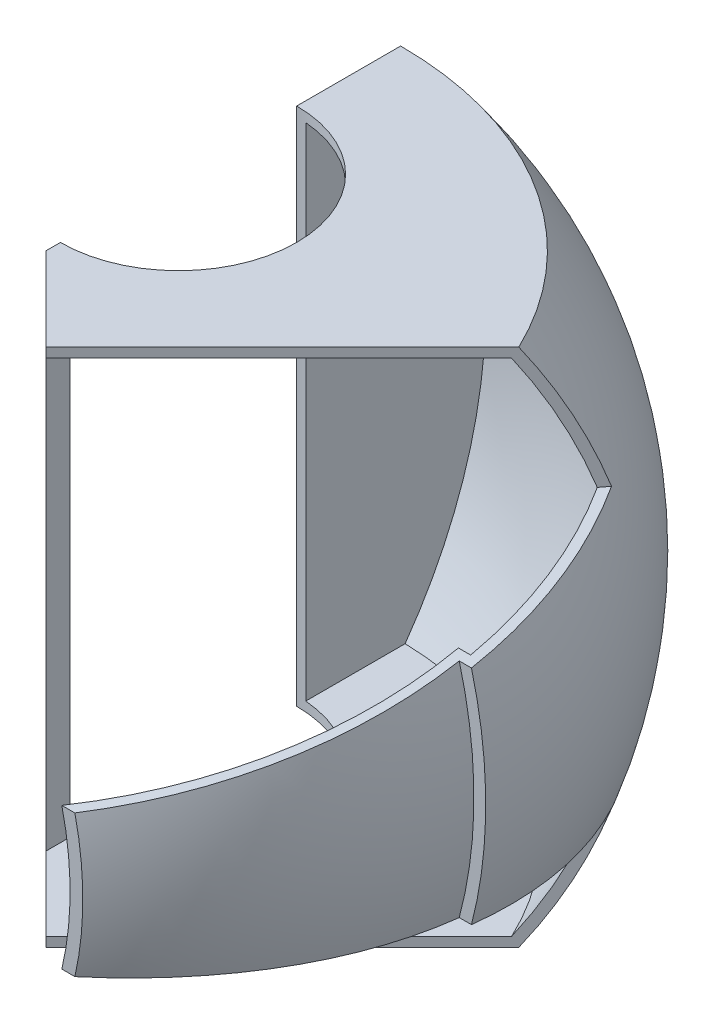
ISO-10303-21;
HEADER;
FILE_DESCRIPTION(('STEP AP214'),'2;1');
FILE_NAME('part.step','',(''),(''),'','','');
FILE_SCHEMA(('AUTOMOTIVE_DESIGN { 1 0 10303 214 1 1 1 1 }'));
ENDSEC;
DATA;
#1=APPLICATION_CONTEXT('core data for automotive mechanical design processes');
#2=APPLICATION_PROTOCOL_DEFINITION('international standard','automotive_design',2000,#1);
#3=PRODUCT_CONTEXT('',#1,'mechanical');
#4=PRODUCT('Part','Part','',(#3));
#5=PRODUCT_RELATED_PRODUCT_CATEGORY('part','',(#4));
#6=PRODUCT_DEFINITION_FORMATION('','',#4);
#7=PRODUCT_DEFINITION_CONTEXT('part definition',#1,'design');
#8=PRODUCT_DEFINITION('design','',#6,#7);
#9=PRODUCT_DEFINITION_SHAPE('','',#8);
#10=(LENGTH_UNIT() NAMED_UNIT(*) SI_UNIT(.MILLI.,.METRE.));
#11=(NAMED_UNIT(*) PLANE_ANGLE_UNIT() SI_UNIT($,.RADIAN.));
#12=(NAMED_UNIT(*) SI_UNIT($,.STERADIAN.) SOLID_ANGLE_UNIT());
#13=UNCERTAINTY_MEASURE_WITH_UNIT(LENGTH_MEASURE(1.E-05),#10,'distance_accuracy_value','');
#14=(GEOMETRIC_REPRESENTATION_CONTEXT(3) GLOBAL_UNCERTAINTY_ASSIGNED_CONTEXT((#13)) GLOBAL_UNIT_ASSIGNED_CONTEXT((#10,
#11,#12)) REPRESENTATION_CONTEXT('',''));
#15=CARTESIAN_POINT('',(0.,0.,0.));
#16=DIRECTION('',(0.,0.,1.));
#17=DIRECTION('',(1.,0.,0.));
#18=AXIS2_PLACEMENT_3D('',#15,#16,#17);
#19=CARTESIAN_POINT('',(-121.513111323989,-30.,-45.6666277669359));
#20=DIRECTION('',(0.,-0.990074030670296,0.140546838428599));
#21=DIRECTION('',(0.,-0.140546838428599,-0.990074030670296));
#22=AXIS2_PLACEMENT_3D('',#19,#20,#21);
#23=PLANE('',#22);
#24=DIRECTION('',(1.,0.,0.));
#25=VECTOR('',#24,1.);
#26=CARTESIAN_POINT('',(-121.513111323989,-15.,60.));
#27=LINE('',#26,#25);
#28=CARTESIAN_POINT('',(63.3028435380276,-15.,60.));
#29=VERTEX_POINT('',#28);
#30=CARTESIAN_POINT('',(66.0700385954178,-15.,60.));
#31=VERTEX_POINT('',#30);
#32=EDGE_CURVE('E326',#29,#31,#27,.T.);
#33=ORIENTED_EDGE('',*,*,#32,.F.);
#34=CARTESIAN_POINT('',(0.,-23.0528052823741,3.27248144985102));
#35=DIRECTION('',(0.,-0.990074030670296,0.140546838428599));
#36=DIRECTION('',(0.,-0.140546838428599,-0.990074030670296));
#37=AXIS2_PLACEMENT_3D('',#34,#35,#36);
#38=CIRCLE('',#37,85.3821353315395);
#39=CARTESIAN_POINT('',(85.2159009873218,-23.8012650697178,-2.0000000000003));
#40=VERTEX_POINT('',#39);
#41=EDGE_CURVE('E210',#29,#40,#38,.F.);
#42=ORIENTED_EDGE('',*,*,#41,.T.);
#43=DIRECTION('',(1.,0.,0.));
#44=VECTOR('',#43,1.);
#45=CARTESIAN_POINT('',(-121.513111323989,-23.8012650697177,-1.99999999999958));
#46=LINE('',#45,#44);
#47=CARTESIAN_POINT('',(87.8094515475472,-23.8012650697178,-2.00000000000031));
#48=VERTEX_POINT('',#47);
#49=EDGE_CURVE('E256',#40,#48,#46,.T.);
#50=ORIENTED_EDGE('',*,*,#49,.T.);
#51=CARTESIAN_POINT('',(0.,-23.0528052823741,3.27248144985102));
#52=DIRECTION('',(0.,-0.990074030670296,0.140546838428599));
#53=DIRECTION('',(0.,-0.140546838428599,-0.990074030670296));
#54=AXIS2_PLACEMENT_3D('',#51,#52,#53);
#55=CIRCLE('',#54,87.9707851151354);
#56=CARTESIAN_POINT('',(75.9804490516821,-29.2843268663261,-40.6251099923547));
#57=VERTEX_POINT('',#56);
#58=EDGE_CURVE('E208',#57,#48,#55,.T.);
#59=ORIENTED_EDGE('',*,*,#58,.F.);
#60=DIRECTION('',(-0.70357116579907,0.0998760697678699,0.70357116579907));
#61=VECTOR('',#60,1.);
#62=CARTESIAN_POINT('',(12.3365999792515,-20.2497077414298,23.0187390800759));
#63=LINE('',#62,#61);
#64=CARTESIAN_POINT('',(77.4851613154388,-29.4979296322451,-42.1298222561114));
#65=VERTEX_POINT('',#64);
#66=EDGE_CURVE('E335',#65,#57,#63,.T.);
#67=ORIENTED_EDGE('',*,*,#66,.F.);
#68=CARTESIAN_POINT('',(0.,-23.0528052823741,3.27248144985102));
#69=DIRECTION('',(0.,-0.990074030670296,0.140546838428599));
#70=DIRECTION('',(0.,-0.140546838428599,-0.990074030670296));
#71=AXIS2_PLACEMENT_3D('',#68,#69,#70);
#72=CIRCLE('',#71,90.0380976796674);
#73=CARTESIAN_POINT('',(89.9774087984271,-23.5173532932753,-3.14503377313479E-13));
#74=VERTEX_POINT('',#73);
#75=EDGE_CURVE('E311',#65,#74,#72,.T.);
#76=ORIENTED_EDGE('',*,*,#75,.T.);
#77=DIRECTION('',(1.,0.,0.));
#78=VECTOR('',#77,1.);
#79=CARTESIAN_POINT('',(-121.513111323989,-23.5173532932752,4.23272528138341E-13));
#80=LINE('',#79,#78);
#81=CARTESIAN_POINT('',(87.3909840548742,-23.5173532932753,-3.05123990010731E-13));
#82=VERTEX_POINT('',#81);
#83=EDGE_CURVE('E290',#82,#74,#80,.T.);
#84=ORIENTED_EDGE('',*,*,#83,.F.);
#85=CARTESIAN_POINT('',(0.,-23.0528052823741,3.27248144985102));
#86=DIRECTION('',(0.,-0.990074030670296,0.140546838428599));
#87=DIRECTION('',(0.,-0.140546838428599,-0.990074030670296));
#88=AXIS2_PLACEMENT_3D('',#85,#86,#87);
#89=CIRCLE('',#88,87.453467820169);
#90=EDGE_CURVE('E297',#31,#82,#89,.F.);
#91=ORIENTED_EDGE('',*,*,#90,.F.);
#92=EDGE_LOOP('',(#33,#42,#50,#59,#67,#76,#84,#91));
#93=FACE_BOUND('',#92,.T.);
#94=ADVANCED_FACE('F41',(#93),#23,.T.);
#95=CARTESIAN_POINT('',(-121.513111323989,30.,-45.6666277669359));
#96=DIRECTION('',(0.,0.990074030670295,0.140546838428599));
#97=DIRECTION('',(0.,-0.140546838428599,0.990074030670296));
#98=AXIS2_PLACEMENT_3D('',#95,#96,#97);
#99=PLANE('',#98);
#100=DIRECTION('',(-1.,0.,0.));
#101=VECTOR('',#100,1.);
#102=CARTESIAN_POINT('',(-121.513111323989,23.8012650697177,-1.99999999999958));
#103=LINE('',#102,#101);
#104=CARTESIAN_POINT('',(87.8094515475472,23.8012650697178,-2.00000000000031));
#105=VERTEX_POINT('',#104);
#106=CARTESIAN_POINT('',(85.2159009873218,23.8012650697178,-2.0000000000003));
#107=VERTEX_POINT('',#106);
#108=EDGE_CURVE('E226',#105,#107,#103,.T.);
#109=ORIENTED_EDGE('',*,*,#108,.T.);
#110=CARTESIAN_POINT('',(0.,23.052805282374,3.27248144985102));
#111=DIRECTION('',(0.,0.990074030670295,0.140546838428599));
#112=DIRECTION('',(0.,-0.140546838428599,0.990074030670296));
#113=AXIS2_PLACEMENT_3D('',#110,#111,#112);
#114=CIRCLE('',#113,85.3821353315395);
#115=CARTESIAN_POINT('',(63.3028435380276,15.,60.));
#116=VERTEX_POINT('',#115);
#117=EDGE_CURVE('E260',#107,#116,#114,.F.);
#118=ORIENTED_EDGE('',*,*,#117,.T.);
#119=DIRECTION('',(1.,0.,0.));
#120=VECTOR('',#119,1.);
#121=CARTESIAN_POINT('',(-121.513111323989,15.,60.));
#122=LINE('',#121,#120);
#123=CARTESIAN_POINT('',(66.0700385954178,15.,60.));
#124=VERTEX_POINT('',#123);
#125=EDGE_CURVE('E329',#116,#124,#122,.T.);
#126=ORIENTED_EDGE('',*,*,#125,.T.);
#127=CARTESIAN_POINT('',(0.,23.052805282374,3.27248144985102));
#128=DIRECTION('',(0.,0.990074030670295,0.140546838428599));
#129=DIRECTION('',(0.,-0.140546838428599,0.990074030670296));
#130=AXIS2_PLACEMENT_3D('',#127,#128,#129);
#131=CIRCLE('',#130,87.453467820169);
#132=CARTESIAN_POINT('',(87.3909840548742,23.5173532932753,-3.05123990010731E-13));
#133=VERTEX_POINT('',#132);
#134=EDGE_CURVE('E293',#133,#124,#131,.F.);
#135=ORIENTED_EDGE('',*,*,#134,.F.);
#136=DIRECTION('',(-1.,0.,0.));
#137=VECTOR('',#136,1.);
#138=CARTESIAN_POINT('',(-121.513111323989,23.5173532932752,4.23272528138341E-13));
#139=LINE('',#138,#137);
#140=CARTESIAN_POINT('',(89.9774087984271,23.5173532932753,-3.14503377313479E-13));
#141=VERTEX_POINT('',#140);
#142=EDGE_CURVE('E287',#141,#133,#139,.T.);
#143=ORIENTED_EDGE('',*,*,#142,.F.);
#144=CARTESIAN_POINT('',(0.,23.052805282374,3.27248144985102));
#145=DIRECTION('',(0.,0.990074030670295,0.140546838428599));
#146=DIRECTION('',(0.,-0.140546838428599,0.990074030670296));
#147=AXIS2_PLACEMENT_3D('',#144,#145,#146);
#148=CIRCLE('',#147,90.0380976796674);
#149=CARTESIAN_POINT('',(77.4851613154388,29.4979296322451,-42.1298222561114));
#150=VERTEX_POINT('',#149);
#151=EDGE_CURVE('E307',#141,#150,#148,.T.);
#152=ORIENTED_EDGE('',*,*,#151,.T.);
#153=DIRECTION('',(0.70357116579907,0.0998760697678701,-0.70357116579907));
#154=VECTOR('',#153,1.);
#155=CARTESIAN_POINT('',(20.0662914918725,21.3469829657802,15.2890475674549));
#156=LINE('',#155,#154);
#157=CARTESIAN_POINT('',(75.9804490516821,29.2843268663261,-40.6251099923547));
#158=VERTEX_POINT('',#157);
#159=EDGE_CURVE('E332',#158,#150,#156,.T.);
#160=ORIENTED_EDGE('',*,*,#159,.F.);
#161=CARTESIAN_POINT('',(0.,23.052805282374,3.27248144985102));
#162=DIRECTION('',(0.,0.990074030670295,0.140546838428599));
#163=DIRECTION('',(0.,-0.140546838428599,0.990074030670296));
#164=AXIS2_PLACEMENT_3D('',#161,#162,#163);
#165=CIRCLE('',#164,87.9707851151354);
#166=EDGE_CURVE('E203',#105,#158,#165,.T.);
#167=ORIENTED_EDGE('',*,*,#166,.F.);
#168=EDGE_LOOP('',(#109,#118,#126,#135,#143,#152,#160,#167));
#169=FACE_BOUND('',#168,.T.);
#170=ADVANCED_FACE('F434',(#169),#99,.T.);
#171=CARTESIAN_POINT('',(0.,55.,0.));
#172=DIRECTION('',(0.707106781186547,0.,-0.707106781186547));
#173=DIRECTION('',(-0.707106781186548,0.,-0.707106781186548));
#174=AXIS2_PLACEMENT_3D('',#171,#172,#173);
#175=PLANE('',#174);
#176=DIRECTION('',(0.707106781186548,0.,0.707106781186548));
#177=VECTOR('',#176,1.);
#178=CARTESIAN_POINT('',(0.,-53.,0.));
#179=LINE('',#178,#177);
#180=CARTESIAN_POINT('',(2.00000000000001,-53.,2.00000000000001));
#181=VERTEX_POINT('',#180);
#182=CARTESIAN_POINT('',(17.6776695296637,-53.,17.6776695296637));
#183=VERTEX_POINT('',#182);
#184=EDGE_CURVE('E196',#181,#183,#179,.T.);
#185=ORIENTED_EDGE('',*,*,#184,.F.);
#186=DIRECTION('',(0.,-1.,0.));
#187=VECTOR('',#186,1.);
#188=CARTESIAN_POINT('',(2.00000000000001,0.,2.00000000000001));
#189=LINE('',#188,#187);
#190=CARTESIAN_POINT('',(2.00000000000001,53.,2.00000000000001));
#191=VERTEX_POINT('',#190);
#192=EDGE_CURVE('E186',#191,#181,#189,.T.);
#193=ORIENTED_EDGE('',*,*,#192,.F.);
#194=DIRECTION('',(0.707106781186548,0.,0.707106781186548));
#195=VECTOR('',#194,1.);
#196=CARTESIAN_POINT('',(0.,53.,0.));
#197=LINE('',#196,#195);
#198=CARTESIAN_POINT('',(17.6776695296637,53.,17.6776695296637));
#199=VERTEX_POINT('',#198);
#200=EDGE_CURVE('E239',#191,#199,#197,.T.);
#201=ORIENTED_EDGE('',*,*,#200,.T.);
#202=DIRECTION('',(0.,-1.,0.));
#203=VECTOR('',#202,1.);
#204=CARTESIAN_POINT('',(17.6776695296637,55.,17.6776695296637));
#205=LINE('',#204,#203);
#206=CARTESIAN_POINT('',(17.6776695296637,55.,17.6776695296637));
#207=VERTEX_POINT('',#206);
#208=EDGE_CURVE('E356',#207,#199,#205,.T.);
#209=ORIENTED_EDGE('',*,*,#208,.F.);
#210=DIRECTION('',(0.707106781186547,0.,0.707106781186547));
#211=VECTOR('',#210,1.);
#212=CARTESIAN_POINT('',(0.,55.,0.));
#213=LINE('',#212,#211);
#214=CARTESIAN_POINT('',(0.,55.,0.));
#215=VERTEX_POINT('',#214);
#216=EDGE_CURVE('E340',#215,#207,#213,.T.);
#217=ORIENTED_EDGE('',*,*,#216,.F.);
#218=DIRECTION('',(0.,-1.,0.));
#219=VECTOR('',#218,1.);
#220=CARTESIAN_POINT('',(0.,55.,0.));
#221=LINE('',#220,#219);
#222=CARTESIAN_POINT('',(0.,-55.,0.));
#223=VERTEX_POINT('',#222);
#224=EDGE_CURVE('E349',#215,#223,#221,.T.);
#225=ORIENTED_EDGE('',*,*,#224,.T.);
#226=DIRECTION('',(0.707106781186547,0.,0.707106781186547));
#227=VECTOR('',#226,1.);
#228=CARTESIAN_POINT('',(0.,-55.,0.));
#229=LINE('',#228,#227);
#230=CARTESIAN_POINT('',(17.6776695296637,-55.,17.6776695296637));
#231=VERTEX_POINT('',#230);
#232=EDGE_CURVE('E339',#223,#231,#229,.T.);
#233=ORIENTED_EDGE('',*,*,#232,.T.);
#234=EDGE_CURVE('E361',#183,#231,#205,.T.);
#235=ORIENTED_EDGE('',*,*,#234,.F.);
#236=EDGE_LOOP('',(#185,#193,#201,#209,#217,#225,#233,#235));
#237=FACE_BOUND('',#236,.T.);
#238=ADVANCED_FACE('F398',(#237),#175,.F.);
#239=CARTESIAN_POINT('',(0.,55.,-28.));
#240=DIRECTION('',(0.,-1.,0.));
#241=DIRECTION('',(0.,0.,-1.));
#242=AXIS2_PLACEMENT_3D('',#239,#240,#241);
#243=CYLINDRICAL_SURFACE('',#242,25.);
#244=DIRECTION('',(0.,-1.,0.));
#245=VECTOR('',#244,1.);
#246=CARTESIAN_POINT('',(-3.70097021917372E-13,55.,-53.));
#247=LINE('',#246,#245);
#248=CARTESIAN_POINT('',(-3.70097021917372E-13,55.,-53.));
#249=VERTEX_POINT('',#248);
#250=CARTESIAN_POINT('',(-3.70097021917372E-13,-55.,-53.));
#251=VERTEX_POINT('',#250);
#252=EDGE_CURVE('E11',#249,#251,#247,.T.);
#253=ORIENTED_EDGE('',*,*,#252,.T.);
#254=CARTESIAN_POINT('',(0.,-55.,-28.));
#255=DIRECTION('',(0.,-1.,0.));
#256=DIRECTION('',(0.,0.,-1.));
#257=AXIS2_PLACEMENT_3D('',#254,#255,#256);
#258=CIRCLE('',#257,25.);
#259=CARTESIAN_POINT('',(0.,-55.,-3.));
#260=VERTEX_POINT('',#259);
#261=EDGE_CURVE('E230',#251,#260,#258,.T.);
#262=ORIENTED_EDGE('',*,*,#261,.T.);
#263=DIRECTION('',(0.,-1.,0.));
#264=VECTOR('',#263,1.);
#265=CARTESIAN_POINT('',(0.,55.,-3.));
#266=LINE('',#265,#264);
#267=CARTESIAN_POINT('',(0.,55.,-3.));
#268=VERTEX_POINT('',#267);
#269=EDGE_CURVE('E50',#260,#268,#266,.F.);
#270=ORIENTED_EDGE('',*,*,#269,.T.);
#271=CARTESIAN_POINT('',(0.,55.,-28.));
#272=DIRECTION('',(0.,-1.,0.));
#273=DIRECTION('',(0.,0.,-1.));
#274=AXIS2_PLACEMENT_3D('',#271,#272,#273);
#275=CIRCLE('',#274,25.);
#276=EDGE_CURVE('E277',#249,#268,#275,.T.);
#277=ORIENTED_EDGE('',*,*,#276,.F.);
#278=EDGE_LOOP('',(#253,#262,#270,#277));
#279=FACE_BOUND('',#278,.T.);
#280=DIRECTION('',(0.,-1.,0.));
#281=VECTOR('',#280,1.);
#282=CARTESIAN_POINT('',(1.99999999999963,53.,-52.9198715887543));
#283=LINE('',#282,#281);
#284=CARTESIAN_POINT('',(1.99999999999963,53.,-52.9198715887543));
#285=VERTEX_POINT('',#284);
#286=CARTESIAN_POINT('',(1.99999999999963,-53.,-52.9198715887543));
#287=VERTEX_POINT('',#286);
#288=EDGE_CURVE('E227',#285,#287,#283,.T.);
#289=ORIENTED_EDGE('',*,*,#288,.F.);
#290=CARTESIAN_POINT('',(0.,53.,-28.));
#291=DIRECTION('',(0.,-1.,0.));
#292=DIRECTION('',(0.,0.,-1.));
#293=AXIS2_PLACEMENT_3D('',#290,#291,#292);
#294=CIRCLE('',#293,25.);
#295=CARTESIAN_POINT('',(1.99999999999998,53.,-3.08012841124577));
#296=VERTEX_POINT('',#295);
#297=EDGE_CURVE('E182',#285,#296,#294,.T.);
#298=ORIENTED_EDGE('',*,*,#297,.T.);
#299=DIRECTION('',(0.,-1.,0.));
#300=VECTOR('',#299,1.);
#301=CARTESIAN_POINT('',(1.99999999999998,-53.,-3.08012841124577));
#302=LINE('',#301,#300);
#303=CARTESIAN_POINT('',(1.99999999999998,-53.,-3.08012841124577));
#304=VERTEX_POINT('',#303);
#305=EDGE_CURVE('E231',#304,#296,#302,.F.);
#306=ORIENTED_EDGE('',*,*,#305,.F.);
#307=CARTESIAN_POINT('',(0.,-53.,-28.));
#308=DIRECTION('',(0.,-1.,0.));
#309=DIRECTION('',(0.,0.,-1.));
#310=AXIS2_PLACEMENT_3D('',#307,#308,#309);
#311=CIRCLE('',#310,25.);
#312=EDGE_CURVE('E232',#287,#304,#311,.T.);
#313=ORIENTED_EDGE('',*,*,#312,.F.);
#314=EDGE_LOOP('',(#289,#298,#306,#313));
#315=FACE_BOUND('',#314,.T.);
#316=ADVANCED_FACE('F382',(#279,#315),#243,.F.);
#317=CARTESIAN_POINT('',(0.,0.,0.));
#318=DIRECTION('',(-1.,0.,0.));
#319=DIRECTION('',(0.,0.,1.));
#320=AXIS2_PLACEMENT_3D('',#317,#318,#319);
#321=PLANE('',#320);
#322=ORIENTED_EDGE('',*,*,#252,.F.);
#323=DIRECTION('',(0.,0.,-1.));
#324=VECTOR('',#323,1.);
#325=CARTESIAN_POINT('',(0.,55.,0.));
#326=LINE('',#325,#324);
#327=CARTESIAN_POINT('',(-5.23675645672742E-13,55.,-74.9933330370107));
#328=VERTEX_POINT('',#327);
#329=EDGE_CURVE('E360',#249,#328,#326,.T.);
#330=ORIENTED_EDGE('',*,*,#329,.T.);
#331=CARTESIAN_POINT('',(0.,0.,0.));
#332=DIRECTION('',(-1.,0.,0.));
#333=DIRECTION('',(0.,0.,1.));
#334=AXIS2_PLACEMENT_3D('',#331,#332,#333);
#335=CIRCLE('',#334,93.);
#336=CARTESIAN_POINT('',(-5.23675645672742E-13,-55.,-74.9933330370107));
#337=VERTEX_POINT('',#336);
#338=EDGE_CURVE('E322',#328,#337,#335,.T.);
#339=ORIENTED_EDGE('',*,*,#338,.T.);
#340=DIRECTION('',(0.,0.,-1.));
#341=VECTOR('',#340,1.);
#342=CARTESIAN_POINT('',(0.,-55.,0.));
#343=LINE('',#342,#341);
#344=EDGE_CURVE('E368',#251,#337,#343,.T.);
#345=ORIENTED_EDGE('',*,*,#344,.F.);
#346=EDGE_LOOP('',(#322,#330,#339,#345));
#347=FACE_BOUND('',#346,.T.);
#348=ADVANCED_FACE('F419',(#347),#321,.T.);
#349=CARTESIAN_POINT('',(-121.513111323989,-15.,60.));
#350=DIRECTION('',(0.,0.,1.));
#351=DIRECTION('',(0.,-1.,0.));
#352=AXIS2_PLACEMENT_3D('',#349,#350,#351);
#353=PLANE('',#352);
#354=ORIENTED_EDGE('',*,*,#125,.F.);
#355=CARTESIAN_POINT('',(0.,0.,60.));
#356=DIRECTION('',(0.,0.,1.));
#357=DIRECTION('',(0.,-1.,0.));
#358=AXIS2_PLACEMENT_3D('',#355,#356,#357);
#359=CIRCLE('',#358,65.0557453266043);
#360=EDGE_CURVE('E222',#116,#29,#359,.F.);
#361=ORIENTED_EDGE('',*,*,#360,.T.);
#362=ORIENTED_EDGE('',*,*,#32,.T.);
#363=CARTESIAN_POINT('',(0.,0.,60.));
#364=DIRECTION('',(0.,0.,1.));
#365=DIRECTION('',(0.,-1.,0.));
#366=AXIS2_PLACEMENT_3D('',#363,#364,#365);
#367=CIRCLE('',#366,67.7513837497065);
#368=EDGE_CURVE('E376',#124,#31,#367,.F.);
#369=ORIENTED_EDGE('',*,*,#368,.F.);
#370=EDGE_LOOP('',(#354,#361,#362,#369));
#371=FACE_BOUND('',#370,.T.);
#372=ADVANCED_FACE('F421',(#371),#353,.T.);
#373=CARTESIAN_POINT('',(17.6776695296637,55.,17.6776695296637));
#374=DIRECTION('',(-0.707106781186548,0.,-0.707106781186548));
#375=DIRECTION('',(-0.707106781186548,0.,0.707106781186548));
#376=AXIS2_PLACEMENT_3D('',#373,#374,#375);
#377=PLANE('',#376);
#378=ORIENTED_EDGE('',*,*,#66,.T.);
#379=CARTESIAN_POINT('',(17.6776695296637,0.,17.6776695296637));
#380=DIRECTION('',(-0.707106781186548,0.,-0.707106781186548));
#381=DIRECTION('',(-0.707106781186548,0.,0.707106781186548));
#382=AXIS2_PLACEMENT_3D('',#379,#380,#381);
#383=CIRCLE('',#382,87.4985714169094);
#384=CARTESIAN_POINT('',(66.9067259902541,-53.,-31.5513869309267));
#385=VERTEX_POINT('',#384);
#386=EDGE_CURVE('E197',#57,#385,#383,.T.);
#387=ORIENTED_EDGE('',*,*,#386,.T.);
#388=DIRECTION('',(0.707106781186548,0.,-0.707106781186548));
#389=VECTOR('',#388,1.);
#390=CARTESIAN_POINT('',(17.6776695296637,-53.,17.6776695296637));
#391=LINE('',#390,#389);
#392=EDGE_CURVE('E242',#183,#385,#391,.T.);
#393=ORIENTED_EDGE('',*,*,#392,.F.);
#394=ORIENTED_EDGE('',*,*,#234,.T.);
#395=DIRECTION('',(0.707106781186548,0.,-0.707106781186548));
#396=VECTOR('',#395,1.);
#397=CARTESIAN_POINT('',(17.6776695296637,-55.,17.6776695296637));
#398=LINE('',#397,#396);
#399=CARTESIAN_POINT('',(67.6726692796387,-55.,-32.3173302203113));
#400=VERTEX_POINT('',#399);
#401=EDGE_CURVE('E345',#231,#400,#398,.T.);
#402=ORIENTED_EDGE('',*,*,#401,.T.);
#403=CARTESIAN_POINT('',(17.6776695296637,0.,17.6776695296637));
#404=DIRECTION('',(-0.707106781186548,0.,-0.707106781186548));
#405=DIRECTION('',(-0.707106781186548,0.,0.707106781186548));
#406=AXIS2_PLACEMENT_3D('',#403,#404,#405);
#407=CIRCLE('',#406,89.5767827062348);
#408=EDGE_CURVE('E319',#65,#400,#407,.T.);
#409=ORIENTED_EDGE('',*,*,#408,.F.);
#410=EDGE_LOOP('',(#378,#387,#393,#394,#402,#409));
#411=FACE_BOUND('',#410,.T.);
#412=ADVANCED_FACE('F405',(#411),#377,.F.);
#413=CARTESIAN_POINT('',(0.,55.,0.));
#414=DIRECTION('',(0.,-1.,0.));
#415=DIRECTION('',(0.,0.,-1.));
#416=AXIS2_PLACEMENT_3D('',#413,#414,#415);
#417=PLANE('',#416);
#418=ORIENTED_EDGE('',*,*,#329,.F.);
#419=ORIENTED_EDGE('',*,*,#276,.T.);
#420=EDGE_CURVE('E364',#215,#268,#326,.T.);
#421=ORIENTED_EDGE('',*,*,#420,.F.);
#422=ORIENTED_EDGE('',*,*,#216,.T.);
#423=DIRECTION('',(0.707106781186548,0.,-0.707106781186548));
#424=VECTOR('',#423,1.);
#425=CARTESIAN_POINT('',(17.6776695296637,55.,17.6776695296637));
#426=LINE('',#425,#424);
#427=CARTESIAN_POINT('',(67.6726692796387,55.,-32.3173302203113));
#428=VERTEX_POINT('',#427);
#429=EDGE_CURVE('E344',#207,#428,#426,.T.);
#430=ORIENTED_EDGE('',*,*,#429,.T.);
#431=CARTESIAN_POINT('',(0.,55.,0.));
#432=DIRECTION('',(0.,-1.,0.));
#433=DIRECTION('',(0.,0.,-1.));
#434=AXIS2_PLACEMENT_3D('',#431,#432,#433);
#435=CIRCLE('',#434,74.9933330370107);
#436=EDGE_CURVE('E304',#328,#428,#435,.T.);
#437=ORIENTED_EDGE('',*,*,#436,.F.);
#438=EDGE_LOOP('',(#418,#419,#421,#422,#430,#437));
#439=FACE_BOUND('',#438,.T.);
#440=ADVANCED_FACE('F391',(#439),#417,.F.);
#441=CARTESIAN_POINT('',(0.,-55.,0.));
#442=DIRECTION('',(0.,-1.,0.));
#443=DIRECTION('',(0.,0.,-1.));
#444=AXIS2_PLACEMENT_3D('',#441,#442,#443);
#445=PLANE('',#444);
#446=ORIENTED_EDGE('',*,*,#261,.F.);
#447=ORIENTED_EDGE('',*,*,#344,.T.);
#448=CARTESIAN_POINT('',(0.,-55.,0.));
#449=DIRECTION('',(0.,-1.,0.));
#450=DIRECTION('',(0.,0.,-1.));
#451=AXIS2_PLACEMENT_3D('',#448,#449,#450);
#452=CIRCLE('',#451,74.9933330370107);
#453=EDGE_CURVE('E300',#337,#400,#452,.T.);
#454=ORIENTED_EDGE('',*,*,#453,.T.);
#455=ORIENTED_EDGE('',*,*,#401,.F.);
#456=ORIENTED_EDGE('',*,*,#232,.F.);
#457=EDGE_CURVE('E369',#223,#260,#343,.T.);
#458=ORIENTED_EDGE('',*,*,#457,.T.);
#459=EDGE_LOOP('',(#446,#447,#454,#455,#456,#458));
#460=FACE_BOUND('',#459,.T.);
#461=ADVANCED_FACE('F43',(#460),#445,.T.);
#462=ORIENTED_EDGE('',*,*,#269,.F.);
#463=ORIENTED_EDGE('',*,*,#457,.F.);
#464=ORIENTED_EDGE('',*,*,#224,.F.);
#465=ORIENTED_EDGE('',*,*,#420,.T.);
#466=EDGE_LOOP('',(#462,#463,#464,#465));
#467=FACE_BOUND('',#466,.T.);
#468=ADVANCED_FACE('F394',(#467),#321,.T.);
#469=DIRECTION('',(0.707106781186548,0.,-0.707106781186548));
#470=VECTOR('',#469,1.);
#471=CARTESIAN_POINT('',(17.6776695296637,53.,17.6776695296637));
#472=LINE('',#471,#470);
#473=CARTESIAN_POINT('',(66.9067259902541,53.,-31.5513869309267));
#474=VERTEX_POINT('',#473);
#475=EDGE_CURVE('E57',#199,#474,#472,.T.);
#476=ORIENTED_EDGE('',*,*,#475,.T.);
#477=CARTESIAN_POINT('',(17.6776695296637,0.,17.6776695296637));
#478=DIRECTION('',(-0.707106781186548,0.,-0.707106781186548));
#479=DIRECTION('',(-0.707106781186548,0.,0.707106781186548));
#480=AXIS2_PLACEMENT_3D('',#477,#478,#479);
#481=CIRCLE('',#480,87.4985714169094);
#482=EDGE_CURVE('E201',#474,#158,#481,.T.);
#483=ORIENTED_EDGE('',*,*,#482,.T.);
#484=ORIENTED_EDGE('',*,*,#159,.T.);
#485=CARTESIAN_POINT('',(17.6776695296637,0.,17.6776695296637));
#486=DIRECTION('',(-0.707106781186548,0.,-0.707106781186548));
#487=DIRECTION('',(-0.707106781186548,0.,0.707106781186548));
#488=AXIS2_PLACEMENT_3D('',#485,#486,#487);
#489=CIRCLE('',#488,89.5767827062348);
#490=EDGE_CURVE('E315',#428,#150,#489,.T.);
#491=ORIENTED_EDGE('',*,*,#490,.F.);
#492=ORIENTED_EDGE('',*,*,#429,.F.);
#493=ORIENTED_EDGE('',*,*,#208,.T.);
#494=EDGE_LOOP('',(#476,#483,#484,#491,#492,#493));
#495=FACE_BOUND('',#494,.T.);
#496=ADVANCED_FACE('F432',(#495),#377,.F.);
#497=CARTESIAN_POINT('',(0.,0.,0.));
#498=DIRECTION('',(0.,-1.,0.));
#499=DIRECTION('',(0.,0.,1.));
#500=AXIS2_PLACEMENT_3D('',#497,#498,#499);
#501=SPHERICAL_SURFACE('',#500,93.);
#502=CARTESIAN_POINT('',(0.,0.,0.));
#503=DIRECTION('',(0.,0.,-1.));
#504=DIRECTION('',(-1.,0.,0.));
#505=AXIS2_PLACEMENT_3D('',#502,#503,#504);
#506=CIRCLE('',#505,93.);
#507=EDGE_CURVE('E373',#74,#141,#506,.F.);
#508=ORIENTED_EDGE('',*,*,#507,.F.);
#509=ORIENTED_EDGE('',*,*,#75,.F.);
#510=ORIENTED_EDGE('',*,*,#408,.T.);
#511=ORIENTED_EDGE('',*,*,#453,.F.);
#512=ORIENTED_EDGE('',*,*,#338,.F.);
#513=ORIENTED_EDGE('',*,*,#436,.T.);
#514=ORIENTED_EDGE('',*,*,#490,.T.);
#515=ORIENTED_EDGE('',*,*,#151,.F.);
#516=EDGE_LOOP('',(#508,#509,#510,#511,#512,#513,#514,#515));
#517=FACE_BOUND('',#516,.T.);
#518=ADVANCED_FACE('F418',(#517),#501,.T.);
#519=CARTESIAN_POINT('',(0.,0.,0.));
#520=DIRECTION('',(0.,-1.,0.));
#521=DIRECTION('',(1.,0.,0.));
#522=AXIS2_PLACEMENT_3D('',#519,#520,#521);
#523=SPHERICAL_SURFACE('',#522,90.5);
#524=ORIENTED_EDGE('',*,*,#90,.T.);
#525=CARTESIAN_POINT('',(0.,0.,0.));
#526=DIRECTION('',(0.,0.,-1.));
#527=DIRECTION('',(-1.,0.,0.));
#528=AXIS2_PLACEMENT_3D('',#525,#526,#527);
#529=CIRCLE('',#528,90.5);
#530=EDGE_CURVE('E281',#133,#82,#529,.T.);
#531=ORIENTED_EDGE('',*,*,#530,.F.);
#532=ORIENTED_EDGE('',*,*,#134,.T.);
#533=ORIENTED_EDGE('',*,*,#368,.T.);
#534=EDGE_LOOP('',(#524,#531,#532,#533));
#535=FACE_BOUND('',#534,.T.);
#536=ADVANCED_FACE('F551',(#535),#523,.T.);
#537=CARTESIAN_POINT('',(0.,0.,0.));
#538=DIRECTION('',(0.,0.,-1.));
#539=DIRECTION('',(-1.,0.,0.));
#540=AXIS2_PLACEMENT_3D('',#537,#538,#539);
#541=PLANE('',#540);
#542=ORIENTED_EDGE('',*,*,#83,.T.);
#543=ORIENTED_EDGE('',*,*,#507,.T.);
#544=ORIENTED_EDGE('',*,*,#142,.T.);
#545=ORIENTED_EDGE('',*,*,#530,.T.);
#546=EDGE_LOOP('',(#542,#543,#544,#545));
#547=FACE_BOUND('',#546,.T.);
#548=ADVANCED_FACE('F489',(#547),#541,.F.);
#549=CARTESIAN_POINT('',(2.,0.,0.));
#550=DIRECTION('',(-1.,0.,0.));
#551=DIRECTION('',(0.,0.,1.));
#552=AXIS2_PLACEMENT_3D('',#549,#550,#551);
#553=PLANE('',#552);
#554=ORIENTED_EDGE('',*,*,#288,.T.);
#555=DIRECTION('',(0.,0.,-1.));
#556=VECTOR('',#555,1.);
#557=CARTESIAN_POINT('',(2.,-53.,0.));
#558=LINE('',#557,#556);
#559=CARTESIAN_POINT('',(1.99999999999948,-53.,-73.9459261893446));
#560=VERTEX_POINT('',#559);
#561=EDGE_CURVE('E192',#287,#560,#558,.T.);
#562=ORIENTED_EDGE('',*,*,#561,.T.);
#563=CARTESIAN_POINT('',(2.,0.,0.));
#564=DIRECTION('',(-1.,0.,0.));
#565=DIRECTION('',(0.,0.,1.));
#566=AXIS2_PLACEMENT_3D('',#563,#564,#565);
#567=CIRCLE('',#566,90.9780193233508);
#568=CARTESIAN_POINT('',(1.99999999999948,53.,-73.9459261893446));
#569=VERTEX_POINT('',#568);
#570=EDGE_CURVE('E189',#569,#560,#567,.T.);
#571=ORIENTED_EDGE('',*,*,#570,.F.);
#572=DIRECTION('',(0.,0.,-1.));
#573=VECTOR('',#572,1.);
#574=CARTESIAN_POINT('',(2.,53.,0.));
#575=LINE('',#574,#573);
#576=EDGE_CURVE('E175',#285,#569,#575,.T.);
#577=ORIENTED_EDGE('',*,*,#576,.F.);
#578=EDGE_LOOP('',(#554,#562,#571,#577));
#579=FACE_BOUND('',#578,.T.);
#580=ADVANCED_FACE('F190',(#579),#553,.F.);
#581=CARTESIAN_POINT('',(0.,53.,0.));
#582=DIRECTION('',(0.,-1.,0.));
#583=DIRECTION('',(0.,0.,-1.));
#584=AXIS2_PLACEMENT_3D('',#581,#582,#583);
#585=PLANE('',#584);
#586=ORIENTED_EDGE('',*,*,#576,.T.);
#587=CARTESIAN_POINT('',(0.,53.,0.));
#588=DIRECTION('',(0.,-1.,0.));
#589=DIRECTION('',(0.,0.,-1.));
#590=AXIS2_PLACEMENT_3D('',#587,#588,#589);
#591=CIRCLE('',#590,73.9729680356277);
#592=EDGE_CURVE('E179',#569,#474,#591,.T.);
#593=ORIENTED_EDGE('',*,*,#592,.T.);
#594=ORIENTED_EDGE('',*,*,#475,.F.);
#595=ORIENTED_EDGE('',*,*,#200,.F.);
#596=DIRECTION('',(0.,0.,-1.));
#597=VECTOR('',#596,1.);
#598=CARTESIAN_POINT('',(2.,53.,0.));
#599=LINE('',#598,#597);
#600=EDGE_CURVE('E63',#191,#296,#599,.T.);
#601=ORIENTED_EDGE('',*,*,#600,.T.);
#602=ORIENTED_EDGE('',*,*,#297,.F.);
#603=EDGE_LOOP('',(#586,#593,#594,#595,#601,#602));
#604=FACE_BOUND('',#603,.T.);
#605=ADVANCED_FACE('F177',(#604),#585,.T.);
#606=CARTESIAN_POINT('',(0.,-53.,0.));
#607=DIRECTION('',(0.,-1.,0.));
#608=DIRECTION('',(0.,0.,-1.));
#609=AXIS2_PLACEMENT_3D('',#606,#607,#608);
#610=PLANE('',#609);
#611=ORIENTED_EDGE('',*,*,#312,.T.);
#612=DIRECTION('',(0.,0.,-1.));
#613=VECTOR('',#612,1.);
#614=CARTESIAN_POINT('',(2.,-53.,0.));
#615=LINE('',#614,#613);
#616=EDGE_CURVE('E215',#181,#304,#615,.T.);
#617=ORIENTED_EDGE('',*,*,#616,.F.);
#618=ORIENTED_EDGE('',*,*,#184,.T.);
#619=ORIENTED_EDGE('',*,*,#392,.T.);
#620=CARTESIAN_POINT('',(0.,-53.,0.));
#621=DIRECTION('',(0.,-1.,0.));
#622=DIRECTION('',(0.,0.,-1.));
#623=AXIS2_PLACEMENT_3D('',#620,#621,#622);
#624=CIRCLE('',#623,73.9729680356277);
#625=EDGE_CURVE('E204',#560,#385,#624,.T.);
#626=ORIENTED_EDGE('',*,*,#625,.F.);
#627=ORIENTED_EDGE('',*,*,#561,.F.);
#628=EDGE_LOOP('',(#611,#617,#618,#619,#626,#627));
#629=FACE_BOUND('',#628,.T.);
#630=ADVANCED_FACE('F501',(#629),#610,.F.);
#631=ORIENTED_EDGE('',*,*,#305,.T.);
#632=ORIENTED_EDGE('',*,*,#600,.F.);
#633=ORIENTED_EDGE('',*,*,#192,.T.);
#634=ORIENTED_EDGE('',*,*,#616,.T.);
#635=EDGE_LOOP('',(#631,#632,#633,#634));
#636=FACE_BOUND('',#635,.T.);
#637=ADVANCED_FACE('F491',(#636),#553,.F.);
#638=CARTESIAN_POINT('',(0.,0.,0.));
#639=DIRECTION('',(0.,-1.,0.));
#640=DIRECTION('',(0.,0.,1.));
#641=AXIS2_PLACEMENT_3D('',#638,#639,#640);
#642=SPHERICAL_SURFACE('',#641,91.);
#643=CARTESIAN_POINT('',(0.,0.,-2.));
#644=DIRECTION('',(0.,0.,-1.));
#645=DIRECTION('',(-1.,0.,0.));
#646=AXIS2_PLACEMENT_3D('',#643,#644,#645);
#647=CIRCLE('',#646,90.9780193233508);
#648=EDGE_CURVE('E218',#48,#105,#647,.F.);
#649=ORIENTED_EDGE('',*,*,#648,.T.);
#650=ORIENTED_EDGE('',*,*,#166,.T.);
#651=ORIENTED_EDGE('',*,*,#482,.F.);
#652=ORIENTED_EDGE('',*,*,#592,.F.);
#653=ORIENTED_EDGE('',*,*,#570,.T.);
#654=ORIENTED_EDGE('',*,*,#625,.T.);
#655=ORIENTED_EDGE('',*,*,#386,.F.);
#656=ORIENTED_EDGE('',*,*,#58,.T.);
#657=EDGE_LOOP('',(#649,#650,#651,#652,#653,#654,#655,#656));
#658=FACE_BOUND('',#657,.T.);
#659=ADVANCED_FACE('F199',(#658),#642,.F.);
#660=CARTESIAN_POINT('',(0.,0.,0.));
#661=DIRECTION('',(0.,-1.,0.));
#662=DIRECTION('',(1.,0.,0.));
#663=AXIS2_PLACEMENT_3D('',#660,#661,#662);
#664=SPHERICAL_SURFACE('',#663,88.5);
#665=ORIENTED_EDGE('',*,*,#41,.F.);
#666=ORIENTED_EDGE('',*,*,#360,.F.);
#667=ORIENTED_EDGE('',*,*,#117,.F.);
#668=CARTESIAN_POINT('',(0.,0.,-2.));
#669=DIRECTION('',(0.,0.,-1.));
#670=DIRECTION('',(-1.,0.,0.));
#671=AXIS2_PLACEMENT_3D('',#668,#669,#670);
#672=CIRCLE('',#671,88.4773982438453);
#673=EDGE_CURVE('E223',#107,#40,#672,.T.);
#674=ORIENTED_EDGE('',*,*,#673,.T.);
#675=EDGE_LOOP('',(#665,#666,#667,#674));
#676=FACE_BOUND('',#675,.T.);
#677=ADVANCED_FACE('F525',(#676),#664,.F.);
#678=CARTESIAN_POINT('',(0.,0.,-2.));
#679=DIRECTION('',(0.,0.,-1.));
#680=DIRECTION('',(-1.,0.,0.));
#681=AXIS2_PLACEMENT_3D('',#678,#679,#680);
#682=PLANE('',#681);
#683=ORIENTED_EDGE('',*,*,#49,.F.);
#684=ORIENTED_EDGE('',*,*,#673,.F.);
#685=ORIENTED_EDGE('',*,*,#108,.F.);
#686=ORIENTED_EDGE('',*,*,#648,.F.);
#687=EDGE_LOOP('',(#683,#684,#685,#686));
#688=FACE_BOUND('',#687,.T.);
#689=ADVANCED_FACE('F534',(#688),#682,.T.);
#690=CLOSED_SHELL('',(#94,#170,#238,#316,#348,#372,#412,#440,#461,#468,#496,#518,#536,#548,#580,
#605,#630,#637,#659,#677,#689));
#691=MANIFOLD_SOLID_BREP('B2',#690);
#692=ADVANCED_BREP_SHAPE_REPRESENTATION('',(#18,#691),#14);
#693=SHAPE_DEFINITION_REPRESENTATION(#9,#692);
ENDSEC;
END-ISO-10303-21;
